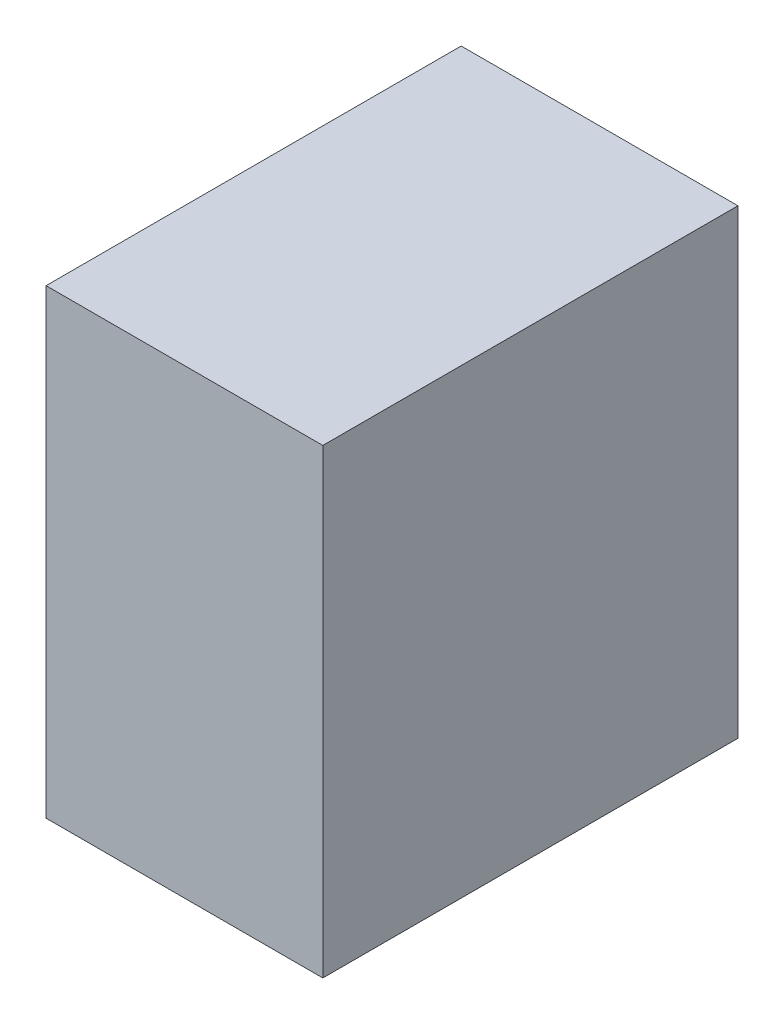
ISO-10303-21;
HEADER;
FILE_DESCRIPTION(('STEP AP214'),'2;1');
FILE_NAME('part.step','',(''),(''),'','','');
FILE_SCHEMA(('AUTOMOTIVE_DESIGN { 1 0 10303 214 1 1 1 1 }'));
ENDSEC;
DATA;
#1=APPLICATION_CONTEXT('core data for automotive mechanical design processes');
#2=APPLICATION_PROTOCOL_DEFINITION('international standard','automotive_design',2000,#1);
#3=PRODUCT_CONTEXT('',#1,'mechanical');
#4=PRODUCT('Part','Part','',(#3));
#5=PRODUCT_RELATED_PRODUCT_CATEGORY('part','',(#4));
#6=PRODUCT_DEFINITION_FORMATION('','',#4);
#7=PRODUCT_DEFINITION_CONTEXT('part definition',#1,'design');
#8=PRODUCT_DEFINITION('design','',#6,#7);
#9=PRODUCT_DEFINITION_SHAPE('','',#8);
#10=(LENGTH_UNIT() NAMED_UNIT(*) SI_UNIT(.MILLI.,.METRE.));
#11=(NAMED_UNIT(*) PLANE_ANGLE_UNIT() SI_UNIT($,.RADIAN.));
#12=(NAMED_UNIT(*) SI_UNIT($,.STERADIAN.) SOLID_ANGLE_UNIT());
#13=UNCERTAINTY_MEASURE_WITH_UNIT(LENGTH_MEASURE(1.E-05),#10,'distance_accuracy_value','');
#14=(GEOMETRIC_REPRESENTATION_CONTEXT(3) GLOBAL_UNCERTAINTY_ASSIGNED_CONTEXT((#13)) GLOBAL_UNIT_ASSIGNED_CONTEXT((#10,
#11,#12)) REPRESENTATION_CONTEXT('',''));
#15=CARTESIAN_POINT('',(0.,0.,0.));
#16=DIRECTION('',(0.,0.,1.));
#17=DIRECTION('',(1.,0.,0.));
#18=AXIS2_PLACEMENT_3D('',#15,#16,#17);
#19=CARTESIAN_POINT('',(-3.30000031472198,-1.79999920882387,-3.30112136363512));
#20=DIRECTION('',(1.,-1.74845553146952E-07,0.));
#21=DIRECTION('',(1.74845553146952E-07,1.,-8.74227765734759E-08));
#22=AXIS2_PLACEMENT_3D('',#19,#20,#21);
#23=PLANE('',#22);
#24=DIRECTION('',(0.,8.74227761787296E-08,0.999999999999996));
#25=VECTOR('',#24,1.);
#26=CARTESIAN_POINT('',(-3.30000013113415,-0.749999204450733,-3.25112145542904));
#27=LINE('',#26,#25);
#28=CARTESIAN_POINT('',(-3.30000013113515,-0.749999204450733,-3.25112145542804));
#29=VERTEX_POINT('',#28);
#30=CARTESIAN_POINT('',(-3.30000013113514,-0.749999125771234,-2.35112145542904));
#31=VERTEX_POINT('',#30);
#32=EDGE_CURVE('E11',#29,#31,#27,.T.);
#33=ORIENTED_EDGE('',*,*,#32,.T.);
#34=DIRECTION('',(-1.74845553146599E-07,-0.999999999999981,8.74227765732993E-08));
#35=VECTOR('',#34,1.);
#36=CARTESIAN_POINT('',(-3.30000013113414,-0.749999125770234,-2.35112145542904));
#37=LINE('',#36,#35);
#38=CARTESIAN_POINT('',(-3.30000030598069,-1.74999912577223,-2.35112136800726));
#39=VERTEX_POINT('',#38);
#40=EDGE_CURVE('E69',#31,#39,#37,.T.);
#41=ORIENTED_EDGE('',*,*,#40,.T.);
#42=DIRECTION('',(0.,-8.7422776672162E-08,-0.999999999999996));
#43=VECTOR('',#42,1.);
#44=CARTESIAN_POINT('',(-3.30000030597969,-1.74999912577223,-2.35112136800626));
#45=LINE('',#44,#43);
#46=CARTESIAN_POINT('',(-3.3000003059807,-1.74999920445173,-3.25112136800626));
#47=VERTEX_POINT('',#46);
#48=EDGE_CURVE('E55',#39,#47,#45,.T.);
#49=ORIENTED_EDGE('',*,*,#48,.T.);
#50=DIRECTION('',(1.74845553146599E-07,0.999999999999981,-8.74227765732993E-08));
#51=VECTOR('',#50,1.);
#52=CARTESIAN_POINT('',(-3.3000003059797,-1.74999920445273,-3.25112136800626));
#53=LINE('',#52,#51);
#54=EDGE_CURVE('E53',#47,#29,#53,.T.);
#55=ORIENTED_EDGE('',*,*,#54,.T.);
#56=EDGE_LOOP('',(#33,#41,#49,#55));
#57=FACE_BOUND('',#56,.T.);
#58=ADVANCED_FACE('F17',(#57),#23,.T.);
#59=CARTESIAN_POINT('',(-3.90000031472198,-1.79999910391654,-3.30112136363513));
#60=DIRECTION('',(1.,-1.74845553146952E-07,0.));
#61=DIRECTION('',(1.74845553146952E-07,1.,-8.74227765734759E-08));
#62=AXIS2_PLACEMENT_3D('',#59,#60,#61);
#63=PLANE('',#62);
#64=DIRECTION('',(1.74845553146599E-07,0.999999999999981,-8.74227765732993E-08));
#65=VECTOR('',#64,1.);
#66=CARTESIAN_POINT('',(-3.9000003059797,-1.7499990995454,-3.25112136800626));
#67=LINE('',#66,#65);
#68=CARTESIAN_POINT('',(-3.9000003059787,-1.7499990995444,-3.25112136800626));
#69=VERTEX_POINT('',#68);
#70=CARTESIAN_POINT('',(-3.90000013113315,-0.749999099543401,-3.25112145542804));
#71=VERTEX_POINT('',#70);
#72=EDGE_CURVE('E24',#69,#71,#67,.T.);
#73=ORIENTED_EDGE('',*,*,#72,.F.);
#74=DIRECTION('',(0.,-8.74227766721621E-08,-0.999999999999996));
#75=VECTOR('',#74,1.);
#76=CARTESIAN_POINT('',(-3.90000030597969,-1.7499990208649,-2.35112136800626));
#77=LINE('',#76,#75);
#78=CARTESIAN_POINT('',(-3.90000030597869,-1.7499990208649,-2.35112136800726));
#79=VERTEX_POINT('',#78);
#80=EDGE_CURVE('E70',#79,#69,#77,.T.);
#81=ORIENTED_EDGE('',*,*,#80,.F.);
#82=DIRECTION('',(-1.74845553146599E-07,-0.999999999999981,8.74227765732994E-08));
#83=VECTOR('',#82,1.);
#84=CARTESIAN_POINT('',(-3.90000013113414,-0.749999020862902,-2.35112145542904));
#85=LINE('',#84,#83);
#86=CARTESIAN_POINT('',(-3.90000013113314,-0.749999020863903,-2.35112145542904));
#87=VERTEX_POINT('',#86);
#88=EDGE_CURVE('E59',#87,#79,#85,.T.);
#89=ORIENTED_EDGE('',*,*,#88,.F.);
#90=DIRECTION('',(0.,8.7422776548804E-08,0.999999999999996));
#91=VECTOR('',#90,1.);
#92=CARTESIAN_POINT('',(-3.90000013113415,-0.749999099543401,-3.25112145542904));
#93=LINE('',#92,#91);
#94=EDGE_CURVE('E78',#71,#87,#93,.T.);
#95=ORIENTED_EDGE('',*,*,#94,.F.);
#96=EDGE_LOOP('',(#73,#81,#89,#95));
#97=FACE_BOUND('',#96,.T.);
#98=ADVANCED_FACE('F89',(#97),#63,.F.);
#99=CARTESIAN_POINT('',(-3.30000013113415,-0.749999204450733,-3.25112145542904));
#100=DIRECTION('',(-1.74845553146952E-07,-1.,8.74227765734759E-08));
#101=DIRECTION('',(0.,8.74227765734759E-08,1.));
#102=AXIS2_PLACEMENT_3D('',#99,#100,#101);
#103=PLANE('',#102);
#104=DIRECTION('',(-0.999999999999985,1.74845553220964E-07,0.));
#105=VECTOR('',#104,1.);
#106=CARTESIAN_POINT('',(-3.30000013113415,-0.749999204450733,-3.25112145542904));
#107=LINE('',#106,#105);
#108=EDGE_CURVE('E65',#29,#71,#107,.T.);
#109=ORIENTED_EDGE('',*,*,#108,.T.);
#110=ORIENTED_EDGE('',*,*,#94,.T.);
#111=DIRECTION('',(-0.999999999999985,1.74845553220964E-07,0.));
#112=VECTOR('',#111,1.);
#113=CARTESIAN_POINT('',(-3.30000013113414,-0.749999125770234,-2.35112145542904));
#114=LINE('',#113,#112);
#115=EDGE_CURVE('E66',#31,#87,#114,.T.);
#116=ORIENTED_EDGE('',*,*,#115,.F.);
#117=ORIENTED_EDGE('',*,*,#32,.F.);
#118=EDGE_LOOP('',(#109,#110,#116,#117));
#119=FACE_BOUND('',#118,.T.);
#120=ADVANCED_FACE('F63',(#119),#103,.F.);
#121=CARTESIAN_POINT('',(-3.30000013113414,-0.749999125770234,-2.35112145542904));
#122=DIRECTION('',(0.,-8.74227765734759E-08,-1.));
#123=DIRECTION('',(-1.74845553146952E-07,-1.,8.74227765734759E-08));
#124=AXIS2_PLACEMENT_3D('',#121,#122,#123);
#125=PLANE('',#124);
#126=ORIENTED_EDGE('',*,*,#115,.T.);
#127=ORIENTED_EDGE('',*,*,#88,.T.);
#128=DIRECTION('',(-0.999999999999985,1.74845553220964E-07,0.));
#129=VECTOR('',#128,1.);
#130=CARTESIAN_POINT('',(-3.30000030597969,-1.74999912577223,-2.35112136800626));
#131=LINE('',#130,#129);
#132=EDGE_CURVE('E60',#39,#79,#131,.T.);
#133=ORIENTED_EDGE('',*,*,#132,.F.);
#134=ORIENTED_EDGE('',*,*,#40,.F.);
#135=EDGE_LOOP('',(#126,#127,#133,#134));
#136=FACE_BOUND('',#135,.T.);
#137=ADVANCED_FACE('F91',(#136),#125,.F.);
#138=CARTESIAN_POINT('',(-3.30000030597969,-1.74999912577223,-2.35112136800626));
#139=DIRECTION('',(1.74845553146952E-07,1.,-8.74227765734759E-08));
#140=DIRECTION('',(0.,-8.74227765734759E-08,-1.));
#141=AXIS2_PLACEMENT_3D('',#138,#139,#140);
#142=PLANE('',#141);
#143=ORIENTED_EDGE('',*,*,#132,.T.);
#144=ORIENTED_EDGE('',*,*,#80,.T.);
#145=DIRECTION('',(-0.999999999999985,1.74845553220964E-07,0.));
#146=VECTOR('',#145,1.);
#147=CARTESIAN_POINT('',(-3.3000003059797,-1.74999920445273,-3.25112136800626));
#148=LINE('',#147,#146);
#149=EDGE_CURVE('E84',#47,#69,#148,.T.);
#150=ORIENTED_EDGE('',*,*,#149,.F.);
#151=ORIENTED_EDGE('',*,*,#48,.F.);
#152=EDGE_LOOP('',(#143,#144,#150,#151));
#153=FACE_BOUND('',#152,.T.);
#154=ADVANCED_FACE('F86',(#153),#142,.F.);
#155=CARTESIAN_POINT('',(-3.3000003059797,-1.74999920445273,-3.25112136800626));
#156=DIRECTION('',(0.,8.74227765734759E-08,1.));
#157=DIRECTION('',(1.74845553146952E-07,1.,-8.74227765734759E-08));
#158=AXIS2_PLACEMENT_3D('',#155,#156,#157);
#159=PLANE('',#158);
#160=ORIENTED_EDGE('',*,*,#149,.T.);
#161=ORIENTED_EDGE('',*,*,#72,.T.);
#162=ORIENTED_EDGE('',*,*,#108,.F.);
#163=ORIENTED_EDGE('',*,*,#54,.F.);
#164=EDGE_LOOP('',(#160,#161,#162,#163));
#165=FACE_BOUND('',#164,.T.);
#166=ADVANCED_FACE('F68',(#165),#159,.F.);
#167=CLOSED_SHELL('',(#58,#98,#120,#137,#154,#166));
#168=MANIFOLD_SOLID_BREP('B1',#167);
#169=ADVANCED_BREP_SHAPE_REPRESENTATION('',(#18,#168),#14);
#170=SHAPE_DEFINITION_REPRESENTATION(#9,#169);
ENDSEC;
END-ISO-10303-21;
